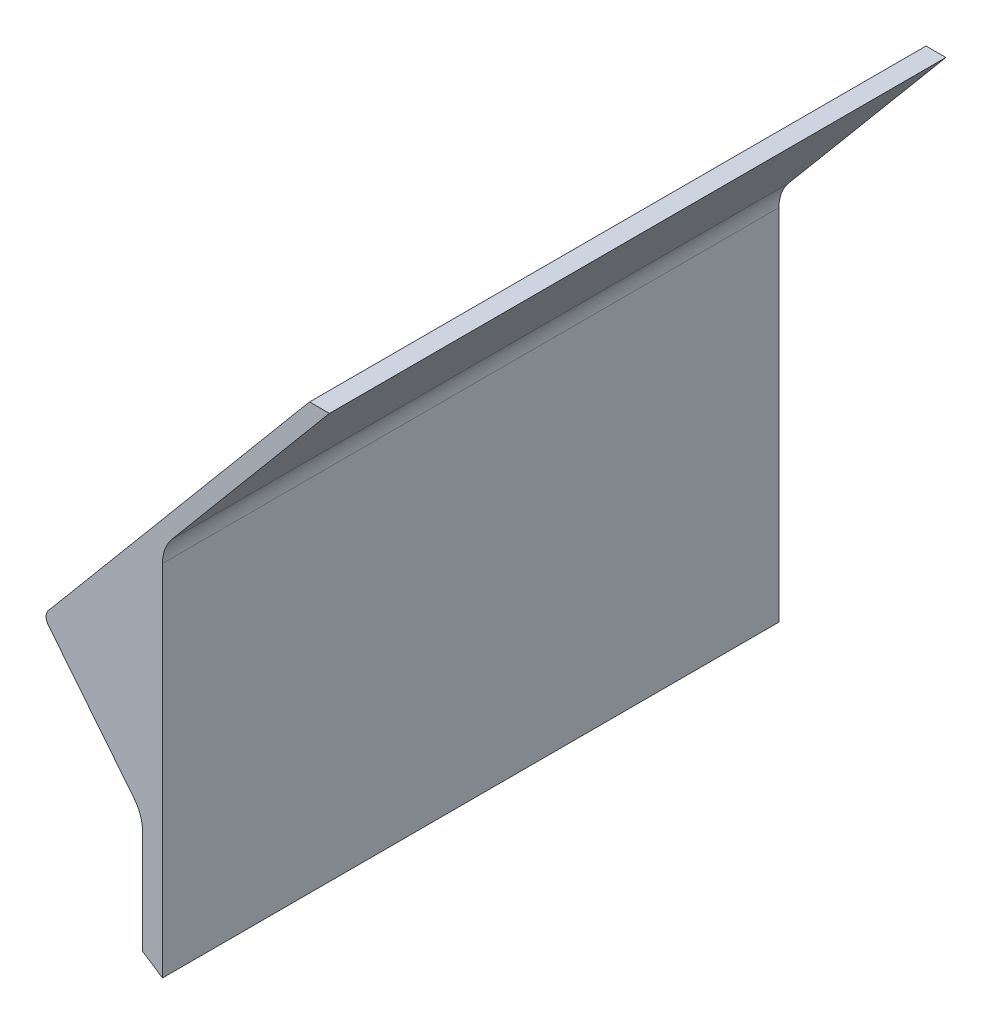
ISO-10303-21;
HEADER;
FILE_DESCRIPTION(('STEP AP214'),'2;1');
FILE_NAME('part.step','',(''),(''),'','','');
FILE_SCHEMA(('AUTOMOTIVE_DESIGN { 1 0 10303 214 1 1 1 1 }'));
ENDSEC;
DATA;
#1=APPLICATION_CONTEXT('core data for automotive mechanical design processes');
#2=APPLICATION_PROTOCOL_DEFINITION('international standard','automotive_design',2000,#1);
#3=PRODUCT_CONTEXT('',#1,'mechanical');
#4=PRODUCT('Part','Part','',(#3));
#5=PRODUCT_RELATED_PRODUCT_CATEGORY('part','',(#4));
#6=PRODUCT_DEFINITION_FORMATION('','',#4);
#7=PRODUCT_DEFINITION_CONTEXT('part definition',#1,'design');
#8=PRODUCT_DEFINITION('design','',#6,#7);
#9=PRODUCT_DEFINITION_SHAPE('','',#8);
#10=(LENGTH_UNIT() NAMED_UNIT(*) SI_UNIT(.MILLI.,.METRE.));
#11=(NAMED_UNIT(*) PLANE_ANGLE_UNIT() SI_UNIT($,.RADIAN.));
#12=(NAMED_UNIT(*) SI_UNIT($,.STERADIAN.) SOLID_ANGLE_UNIT());
#13=UNCERTAINTY_MEASURE_WITH_UNIT(LENGTH_MEASURE(1.E-05),#10,'distance_accuracy_value','');
#14=(GEOMETRIC_REPRESENTATION_CONTEXT(3) GLOBAL_UNCERTAINTY_ASSIGNED_CONTEXT((#13)) GLOBAL_UNIT_ASSIGNED_CONTEXT((#10,
#11,#12)) REPRESENTATION_CONTEXT('',''));
#15=CARTESIAN_POINT('',(0.,0.,0.));
#16=DIRECTION('',(0.,0.,1.));
#17=DIRECTION('',(1.,0.,0.));
#18=AXIS2_PLACEMENT_3D('',#15,#16,#17);
#19=CARTESIAN_POINT('',(-90.,-132.28756555323,155.));
#20=DIRECTION('',(0.,0.,-1.));
#21=DIRECTION('',(-1.,0.,0.));
#22=AXIS2_PLACEMENT_3D('',#19,#20,#21);
#23=CYLINDRICAL_SURFACE('',#22,160.);
#24=CARTESIAN_POINT('',(-90.,-132.28756555323,0.));
#25=DIRECTION('',(0.,0.,-1.));
#26=DIRECTION('',(1.,0.,0.));
#27=AXIS2_PLACEMENT_3D('',#24,#25,#26);
#28=CIRCLE('',#27,160.);
#29=CARTESIAN_POINT('',(-5.,3.26685156403007,0.));
#30=VERTEX_POINT('',#29);
#31=CARTESIAN_POINT('',(0.,0.,0.));
#32=VERTEX_POINT('',#31);
#33=EDGE_CURVE('E137',#30,#32,#28,.T.);
#34=ORIENTED_EDGE('',*,*,#33,.T.);
#35=DIRECTION('',(0.,0.,-1.));
#36=VECTOR('',#35,1.);
#37=CARTESIAN_POINT('',(0.,0.,155.));
#38=LINE('',#37,#36);
#39=CARTESIAN_POINT('',(0.,0.,155.));
#40=VERTEX_POINT('',#39);
#41=EDGE_CURVE('E118',#40,#32,#38,.T.);
#42=ORIENTED_EDGE('',*,*,#41,.F.);
#43=CARTESIAN_POINT('',(-90.,-132.28756555323,155.));
#44=DIRECTION('',(0.,0.,-1.));
#45=DIRECTION('',(1.,0.,0.));
#46=AXIS2_PLACEMENT_3D('',#43,#44,#45);
#47=CIRCLE('',#46,160.);
#48=CARTESIAN_POINT('',(-5.,3.26685156403007,155.));
#49=VERTEX_POINT('',#48);
#50=EDGE_CURVE('E125',#49,#40,#47,.T.);
#51=ORIENTED_EDGE('',*,*,#50,.F.);
#52=DIRECTION('',(0.,0.,-1.));
#53=VECTOR('',#52,1.);
#54=CARTESIAN_POINT('',(-5.,3.26685156403007,155.));
#55=LINE('',#54,#53);
#56=EDGE_CURVE('E185',#49,#30,#55,.T.);
#57=ORIENTED_EDGE('',*,*,#56,.T.);
#58=EDGE_LOOP('',(#34,#42,#51,#57));
#59=FACE_BOUND('',#58,.T.);
#60=ADVANCED_FACE('F36',(#59),#23,.F.);
#61=CARTESIAN_POINT('',(0.,0.,155.));
#62=DIRECTION('',(-1.,0.,0.));
#63=DIRECTION('',(0.,0.,1.));
#64=AXIS2_PLACEMENT_3D('',#61,#62,#63);
#65=PLANE('',#64);
#66=DIRECTION('',(0.,1.,0.));
#67=VECTOR('',#66,1.);
#68=CARTESIAN_POINT('',(0.,0.,0.));
#69=LINE('',#68,#67);
#70=CARTESIAN_POINT('',(0.,90.260297657338,0.));
#71=VERTEX_POINT('',#70);
#72=EDGE_CURVE('E195',#32,#71,#69,.T.);
#73=ORIENTED_EDGE('',*,*,#72,.T.);
#74=DIRECTION('',(0.,0.,-1.));
#75=VECTOR('',#74,1.);
#76=CARTESIAN_POINT('',(0.,90.260297657338,155.));
#77=LINE('',#76,#75);
#78=CARTESIAN_POINT('',(0.,90.260297657338,155.));
#79=VERTEX_POINT('',#78);
#80=EDGE_CURVE('E121',#71,#79,#77,.F.);
#81=ORIENTED_EDGE('',*,*,#80,.T.);
#82=DIRECTION('',(0.,1.,0.));
#83=VECTOR('',#82,1.);
#84=CARTESIAN_POINT('',(0.,0.,155.));
#85=LINE('',#84,#83);
#86=EDGE_CURVE('E113',#40,#79,#85,.T.);
#87=ORIENTED_EDGE('',*,*,#86,.F.);
#88=ORIENTED_EDGE('',*,*,#41,.T.);
#89=EDGE_LOOP('',(#73,#81,#87,#88));
#90=FACE_BOUND('',#89,.T.);
#91=ADVANCED_FACE('F116',(#90),#65,.F.);
#92=CARTESIAN_POINT('',(0.,93.9,155.));
#93=DIRECTION('',(-0.766044443118977,0.64278760968654,0.));
#94=DIRECTION('',(-0.64278760968654,-0.766044443118977,0.));
#95=AXIS2_PLACEMENT_3D('',#92,#93,#94);
#96=PLANE('',#95);
#97=DIRECTION('',(0.64278760968654,0.766044443118977,0.));
#98=VECTOR('',#97,1.);
#99=CARTESIAN_POINT('',(0.,93.9,155.));
#100=LINE('',#99,#98);
#101=CARTESIAN_POINT('',(2.33955556881023,96.6881737542034,155.));
#102=VERTEX_POINT('',#101);
#103=CARTESIAN_POINT('',(41.9740309125311,143.922702135669,155.));
#104=VERTEX_POINT('',#103);
#105=EDGE_CURVE('E124',#102,#104,#100,.T.);
#106=ORIENTED_EDGE('',*,*,#105,.F.);
#107=DIRECTION('',(0.,0.,-1.));
#108=VECTOR('',#107,1.);
#109=CARTESIAN_POINT('',(2.33955556881023,96.6881737542034,0.));
#110=LINE('',#109,#108);
#111=CARTESIAN_POINT('',(2.33955556881023,96.6881737542034,0.));
#112=VERTEX_POINT('',#111);
#113=EDGE_CURVE('E151',#102,#112,#110,.T.);
#114=ORIENTED_EDGE('',*,*,#113,.T.);
#115=DIRECTION('',(0.64278760968654,0.766044443118977,0.));
#116=VECTOR('',#115,1.);
#117=CARTESIAN_POINT('',(0.,93.9,0.));
#118=LINE('',#117,#116);
#119=CARTESIAN_POINT('',(41.9740309125311,143.922702135669,0.));
#120=VERTEX_POINT('',#119);
#121=EDGE_CURVE('E194',#112,#120,#118,.T.);
#122=ORIENTED_EDGE('',*,*,#121,.T.);
#123=DIRECTION('',(0.,0.,-1.));
#124=VECTOR('',#123,1.);
#125=CARTESIAN_POINT('',(41.9740309125311,143.922702135669,155.));
#126=LINE('',#125,#124);
#127=EDGE_CURVE('E139',#104,#120,#126,.T.);
#128=ORIENTED_EDGE('',*,*,#127,.F.);
#129=EDGE_LOOP('',(#106,#114,#122,#128));
#130=FACE_BOUND('',#129,.T.);
#131=ADVANCED_FACE('F209',(#130),#96,.F.);
#132=CARTESIAN_POINT('',(41.9740309125311,143.922702135669,155.));
#133=DIRECTION('',(0.,-1.,0.));
#134=DIRECTION('',(1.,0.,0.));
#135=AXIS2_PLACEMENT_3D('',#132,#133,#134);
#136=PLANE('',#135);
#137=DIRECTION('',(-1.,0.,0.));
#138=VECTOR('',#137,1.);
#139=CARTESIAN_POINT('',(41.9740309125311,143.922702135669,0.));
#140=LINE('',#139,#138);
#141=CARTESIAN_POINT('',(36.9740309125311,143.922702135669,0.));
#142=VERTEX_POINT('',#141);
#143=EDGE_CURVE('E181',#120,#142,#140,.T.);
#144=ORIENTED_EDGE('',*,*,#143,.T.);
#145=DIRECTION('',(0.,0.,-1.));
#146=VECTOR('',#145,1.);
#147=CARTESIAN_POINT('',(36.9740309125311,143.922702135669,155.));
#148=LINE('',#147,#146);
#149=CARTESIAN_POINT('',(36.9740309125311,143.922702135669,155.));
#150=VERTEX_POINT('',#149);
#151=EDGE_CURVE('E145',#150,#142,#148,.T.);
#152=ORIENTED_EDGE('',*,*,#151,.F.);
#153=DIRECTION('',(-1.,0.,0.));
#154=VECTOR('',#153,1.);
#155=CARTESIAN_POINT('',(41.9740309125311,143.922702135669,155.));
#156=LINE('',#155,#154);
#157=EDGE_CURVE('E203',#104,#150,#156,.T.);
#158=ORIENTED_EDGE('',*,*,#157,.F.);
#159=ORIENTED_EDGE('',*,*,#127,.T.);
#160=EDGE_LOOP('',(#144,#152,#158,#159));
#161=FACE_BOUND('',#160,.T.);
#162=ADVANCED_FACE('F210',(#161),#136,.F.);
#163=CARTESIAN_POINT('',(36.9740309125311,143.922702135669,155.));
#164=DIRECTION('',(0.766044443118977,-0.64278760968654,0.));
#165=DIRECTION('',(0.64278760968654,0.766044443118977,0.));
#166=AXIS2_PLACEMENT_3D('',#163,#164,#165);
#167=PLANE('',#166);
#168=DIRECTION('',(-0.64278760968654,-0.766044443118977,0.));
#169=VECTOR('',#168,1.);
#170=CARTESIAN_POINT('',(36.9740309125311,143.922702135669,0.));
#171=LINE('',#170,#169);
#172=CARTESIAN_POINT('',(-28.6827852863566,65.6759555523472,0.));
#173=VERTEX_POINT('',#172);
#174=EDGE_CURVE('E178',#142,#173,#171,.T.);
#175=ORIENTED_EDGE('',*,*,#174,.T.);
#176=DIRECTION('',(0.,0.,-1.));
#177=VECTOR('',#176,1.);
#178=CARTESIAN_POINT('',(-28.6827852863566,65.6759555523472,155.));
#179=LINE('',#178,#177);
#180=CARTESIAN_POINT('',(-28.6827852863566,65.6759555523472,155.));
#181=VERTEX_POINT('',#180);
#182=EDGE_CURVE('E44',#173,#181,#179,.F.);
#183=ORIENTED_EDGE('',*,*,#182,.T.);
#184=DIRECTION('',(-0.64278760968654,-0.766044443118977,0.));
#185=VECTOR('',#184,1.);
#186=CARTESIAN_POINT('',(36.9740309125311,143.922702135669,155.));
#187=LINE('',#186,#185);
#188=EDGE_CURVE('E189',#150,#181,#187,.T.);
#189=ORIENTED_EDGE('',*,*,#188,.F.);
#190=ORIENTED_EDGE('',*,*,#151,.T.);
#191=EDGE_LOOP('',(#175,#183,#189,#190));
#192=FACE_BOUND('',#191,.T.);
#193=ADVANCED_FACE('F188',(#192),#167,.F.);
#194=CARTESIAN_POINT('',(-30.,64.1061601851448,155.));
#195=DIRECTION('',(0.7806247497998,0.625,0.));
#196=DIRECTION('',(-0.625,0.7806247497998,0.));
#197=AXIS2_PLACEMENT_3D('',#194,#195,#196);
#198=PLANE('',#197);
#199=DIRECTION('',(0.625,-0.7806247497998,0.));
#200=VECTOR('',#199,1.);
#201=CARTESIAN_POINT('',(-30.,64.1061601851448,155.));
#202=LINE('',#201,#200);
#203=CARTESIAN_POINT('',(-28.7192360530587,62.5064865281309,155.));
#204=VERTEX_POINT('',#203);
#205=CARTESIAN_POINT('',(-7.19375250200201,35.6211661899496,155.));
#206=VERTEX_POINT('',#205);
#207=EDGE_CURVE('E172',#204,#206,#202,.T.);
#208=ORIENTED_EDGE('',*,*,#207,.F.);
#209=DIRECTION('',(0.,0.,-1.));
#210=VECTOR('',#209,1.);
#211=CARTESIAN_POINT('',(-28.7192360530587,62.5064865281309,155.));
#212=LINE('',#211,#210);
#213=CARTESIAN_POINT('',(-28.7192360530587,62.5064865281309,0.));
#214=VERTEX_POINT('',#213);
#215=EDGE_CURVE('E164',#204,#214,#212,.T.);
#216=ORIENTED_EDGE('',*,*,#215,.T.);
#217=DIRECTION('',(0.625,-0.7806247497998,0.));
#218=VECTOR('',#217,1.);
#219=CARTESIAN_POINT('',(-30.,64.1061601851448,0.));
#220=LINE('',#219,#218);
#221=CARTESIAN_POINT('',(-7.19375250200201,35.6211661899496,0.));
#222=VERTEX_POINT('',#221);
#223=EDGE_CURVE('E171',#214,#222,#220,.T.);
#224=ORIENTED_EDGE('',*,*,#223,.T.);
#225=DIRECTION('',(0.,0.,-1.));
#226=VECTOR('',#225,1.);
#227=CARTESIAN_POINT('',(-7.19375250200201,35.6211661899496,155.));
#228=LINE('',#227,#226);
#229=EDGE_CURVE('E142',#222,#206,#228,.F.);
#230=ORIENTED_EDGE('',*,*,#229,.T.);
#231=EDGE_LOOP('',(#208,#216,#224,#230));
#232=FACE_BOUND('',#231,.T.);
#233=ADVANCED_FACE('F170',(#232),#198,.F.);
#234=CARTESIAN_POINT('',(-5.,32.8811701931528,155.));
#235=DIRECTION('',(1.,0.,0.));
#236=DIRECTION('',(0.,0.,-1.));
#237=AXIS2_PLACEMENT_3D('',#234,#235,#236);
#238=PLANE('',#237);
#239=DIRECTION('',(0.,-1.,0.));
#240=VECTOR('',#239,1.);
#241=CARTESIAN_POINT('',(-5.,32.8811701931528,155.));
#242=LINE('',#241,#240);
#243=CARTESIAN_POINT('',(-5.,29.3711661899496,155.));
#244=VERTEX_POINT('',#243);
#245=EDGE_CURVE('E130',#244,#49,#242,.T.);
#246=ORIENTED_EDGE('',*,*,#245,.F.);
#247=DIRECTION('',(0.,0.,-1.));
#248=VECTOR('',#247,1.);
#249=CARTESIAN_POINT('',(-5.,29.3711661899496,0.));
#250=LINE('',#249,#248);
#251=CARTESIAN_POINT('',(-5.,29.3711661899496,0.));
#252=VERTEX_POINT('',#251);
#253=EDGE_CURVE('E138',#244,#252,#250,.T.);
#254=ORIENTED_EDGE('',*,*,#253,.T.);
#255=DIRECTION('',(0.,-1.,0.));
#256=VECTOR('',#255,1.);
#257=CARTESIAN_POINT('',(-5.,32.8811701931528,0.));
#258=LINE('',#257,#256);
#259=EDGE_CURVE('E134',#252,#30,#258,.T.);
#260=ORIENTED_EDGE('',*,*,#259,.T.);
#261=ORIENTED_EDGE('',*,*,#56,.F.);
#262=EDGE_LOOP('',(#246,#254,#260,#261));
#263=FACE_BOUND('',#262,.T.);
#264=ADVANCED_FACE('F236',(#263),#238,.F.);
#265=CARTESIAN_POINT('',(-90.,-132.28756555323,155.));
#266=DIRECTION('',(0.,0.,1.));
#267=DIRECTION('',(1.,0.,0.));
#268=AXIS2_PLACEMENT_3D('',#265,#266,#267);
#269=PLANE('',#268);
#270=ORIENTED_EDGE('',*,*,#188,.T.);
#271=CARTESIAN_POINT('',(-26.7676741785592,64.0689865281309,155.));
#272=DIRECTION('',(0.,0.,1.));
#273=DIRECTION('',(1.,0.,0.));
#274=AXIS2_PLACEMENT_3D('',#271,#272,#273);
#275=CIRCLE('',#274,2.5);
#276=EDGE_CURVE('E11',#181,#204,#275,.T.);
#277=ORIENTED_EDGE('',*,*,#276,.T.);
#278=ORIENTED_EDGE('',*,*,#207,.T.);
#279=CARTESIAN_POINT('',(-15.,29.3711661899496,155.));
#280=DIRECTION('',(0.,0.,1.));
#281=DIRECTION('',(1.,0.,0.));
#282=AXIS2_PLACEMENT_3D('',#279,#280,#281);
#283=CIRCLE('',#282,10.);
#284=EDGE_CURVE('E158',#206,#244,#283,.F.);
#285=ORIENTED_EDGE('',*,*,#284,.T.);
#286=ORIENTED_EDGE('',*,*,#245,.T.);
#287=ORIENTED_EDGE('',*,*,#50,.T.);
#288=ORIENTED_EDGE('',*,*,#86,.T.);
#289=CARTESIAN_POINT('',(10.,90.260297657338,155.));
#290=DIRECTION('',(0.,0.,1.));
#291=DIRECTION('',(1.,0.,0.));
#292=AXIS2_PLACEMENT_3D('',#289,#290,#291);
#293=CIRCLE('',#292,10.);
#294=EDGE_CURVE('E162',#79,#102,#293,.F.);
#295=ORIENTED_EDGE('',*,*,#294,.T.);
#296=ORIENTED_EDGE('',*,*,#105,.T.);
#297=ORIENTED_EDGE('',*,*,#157,.T.);
#298=EDGE_LOOP('',(#270,#277,#278,#285,#286,#287,#288,#295,#296,#297));
#299=FACE_BOUND('',#298,.T.);
#300=ADVANCED_FACE('F128',(#299),#269,.T.);
#301=CARTESIAN_POINT('',(-90.,-132.28756555323,0.));
#302=DIRECTION('',(0.,0.,1.));
#303=DIRECTION('',(1.,0.,0.));
#304=AXIS2_PLACEMENT_3D('',#301,#302,#303);
#305=PLANE('',#304);
#306=ORIENTED_EDGE('',*,*,#223,.F.);
#307=CARTESIAN_POINT('',(-26.7676741785592,64.0689865281309,0.));
#308=DIRECTION('',(0.,0.,1.));
#309=DIRECTION('',(1.,0.,0.));
#310=AXIS2_PLACEMENT_3D('',#307,#308,#309);
#311=CIRCLE('',#310,2.5);
#312=EDGE_CURVE('E58',#214,#173,#311,.F.);
#313=ORIENTED_EDGE('',*,*,#312,.T.);
#314=ORIENTED_EDGE('',*,*,#174,.F.);
#315=ORIENTED_EDGE('',*,*,#143,.F.);
#316=ORIENTED_EDGE('',*,*,#121,.F.);
#317=CARTESIAN_POINT('',(10.,90.260297657338,0.));
#318=DIRECTION('',(0.,0.,1.));
#319=DIRECTION('',(1.,0.,0.));
#320=AXIS2_PLACEMENT_3D('',#317,#318,#319);
#321=CIRCLE('',#320,10.);
#322=EDGE_CURVE('E160',#112,#71,#321,.T.);
#323=ORIENTED_EDGE('',*,*,#322,.T.);
#324=ORIENTED_EDGE('',*,*,#72,.F.);
#325=ORIENTED_EDGE('',*,*,#33,.F.);
#326=ORIENTED_EDGE('',*,*,#259,.F.);
#327=CARTESIAN_POINT('',(-15.,29.3711661899496,0.));
#328=DIRECTION('',(0.,0.,1.));
#329=DIRECTION('',(1.,0.,0.));
#330=AXIS2_PLACEMENT_3D('',#327,#328,#329);
#331=CIRCLE('',#330,10.);
#332=EDGE_CURVE('E155',#252,#222,#331,.T.);
#333=ORIENTED_EDGE('',*,*,#332,.T.);
#334=EDGE_LOOP('',(#306,#313,#314,#315,#316,#323,#324,#325,#326,#333));
#335=FACE_BOUND('',#334,.T.);
#336=ADVANCED_FACE('F175',(#335),#305,.F.);
#337=CARTESIAN_POINT('',(-15.,29.3711661899496,155.));
#338=DIRECTION('',(0.,0.,1.));
#339=DIRECTION('',(1.,0.,0.));
#340=AXIS2_PLACEMENT_3D('',#337,#338,#339);
#341=CYLINDRICAL_SURFACE('',#340,10.);
#342=ORIENTED_EDGE('',*,*,#284,.F.);
#343=ORIENTED_EDGE('',*,*,#229,.F.);
#344=ORIENTED_EDGE('',*,*,#332,.F.);
#345=ORIENTED_EDGE('',*,*,#253,.F.);
#346=EDGE_LOOP('',(#342,#343,#344,#345));
#347=FACE_BOUND('',#346,.T.);
#348=ADVANCED_FACE('F226',(#347),#341,.F.);
#349=CARTESIAN_POINT('',(10.,90.260297657338,155.));
#350=DIRECTION('',(0.,0.,1.));
#351=DIRECTION('',(1.,0.,0.));
#352=AXIS2_PLACEMENT_3D('',#349,#350,#351);
#353=CYLINDRICAL_SURFACE('',#352,10.);
#354=ORIENTED_EDGE('',*,*,#294,.F.);
#355=ORIENTED_EDGE('',*,*,#80,.F.);
#356=ORIENTED_EDGE('',*,*,#322,.F.);
#357=ORIENTED_EDGE('',*,*,#113,.F.);
#358=EDGE_LOOP('',(#354,#355,#356,#357));
#359=FACE_BOUND('',#358,.T.);
#360=ADVANCED_FACE('F228',(#359),#353,.F.);
#361=CARTESIAN_POINT('',(-26.7676741785592,64.0689865281309,155.));
#362=DIRECTION('',(0.,0.,-1.));
#363=DIRECTION('',(-1.,0.,0.));
#364=AXIS2_PLACEMENT_3D('',#361,#362,#363);
#365=CYLINDRICAL_SURFACE('',#364,2.5);
#366=ORIENTED_EDGE('',*,*,#276,.F.);
#367=ORIENTED_EDGE('',*,*,#182,.F.);
#368=ORIENTED_EDGE('',*,*,#312,.F.);
#369=ORIENTED_EDGE('',*,*,#215,.F.);
#370=EDGE_LOOP('',(#366,#367,#368,#369));
#371=FACE_BOUND('',#370,.T.);
#372=ADVANCED_FACE('F38',(#371),#365,.T.);
#373=CLOSED_SHELL('',(#60,#91,#131,#162,#193,#233,#264,#300,#336,#348,#360,#372));
#374=MANIFOLD_SOLID_BREP('B2',#373);
#375=ADVANCED_BREP_SHAPE_REPRESENTATION('',(#18,#374),#14);
#376=SHAPE_DEFINITION_REPRESENTATION(#9,#375);
ENDSEC;
END-ISO-10303-21;
